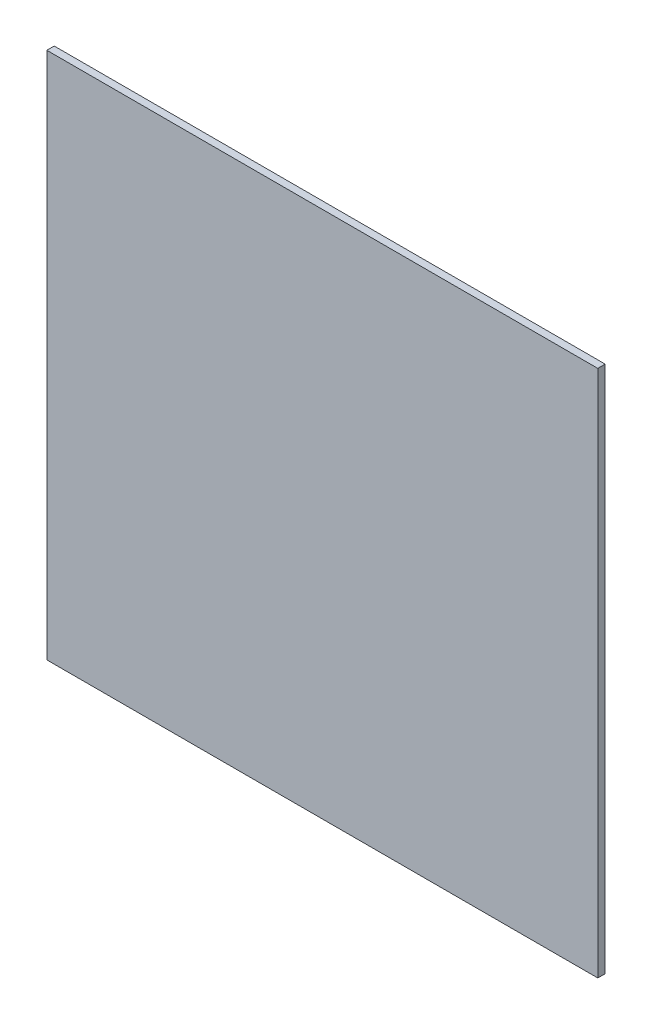
ISO-10303-21;
HEADER;
FILE_DESCRIPTION(('STEP AP214'),'2;1');
FILE_NAME('part.step','',(''),(''),'','','');
FILE_SCHEMA(('AUTOMOTIVE_DESIGN { 1 0 10303 214 1 1 1 1 }'));
ENDSEC;
DATA;
#1=APPLICATION_CONTEXT('core data for automotive mechanical design processes');
#2=APPLICATION_PROTOCOL_DEFINITION('international standard','automotive_design',2000,#1);
#3=PRODUCT_CONTEXT('',#1,'mechanical');
#4=PRODUCT('Part','Part','',(#3));
#5=PRODUCT_RELATED_PRODUCT_CATEGORY('part','',(#4));
#6=PRODUCT_DEFINITION_FORMATION('','',#4);
#7=PRODUCT_DEFINITION_CONTEXT('part definition',#1,'design');
#8=PRODUCT_DEFINITION('design','',#6,#7);
#9=PRODUCT_DEFINITION_SHAPE('','',#8);
#10=(LENGTH_UNIT() NAMED_UNIT(*) SI_UNIT(.MILLI.,.METRE.));
#11=(NAMED_UNIT(*) PLANE_ANGLE_UNIT() SI_UNIT($,.RADIAN.));
#12=(NAMED_UNIT(*) SI_UNIT($,.STERADIAN.) SOLID_ANGLE_UNIT());
#13=UNCERTAINTY_MEASURE_WITH_UNIT(LENGTH_MEASURE(1.E-05),#10,'distance_accuracy_value','');
#14=(GEOMETRIC_REPRESENTATION_CONTEXT(3) GLOBAL_UNCERTAINTY_ASSIGNED_CONTEXT((#13)) GLOBAL_UNIT_ASSIGNED_CONTEXT((#10,
#11,#12)) REPRESENTATION_CONTEXT('',''));
#15=CARTESIAN_POINT('',(0.,0.,0.));
#16=DIRECTION('',(0.,0.,1.));
#17=DIRECTION('',(1.,0.,0.));
#18=AXIS2_PLACEMENT_3D('',#15,#16,#17);
#19=CARTESIAN_POINT('',(161.925,-155.1686,4.3434));
#20=DIRECTION('',(-1.,0.,0.));
#21=DIRECTION('',(0.,0.,1.));
#22=AXIS2_PLACEMENT_3D('',#19,#20,#21);
#23=PLANE('',#22);
#24=DIRECTION('',(0.,1.,0.));
#25=VECTOR('',#24,1.);
#26=CARTESIAN_POINT('',(161.925,-155.1686,0.));
#27=LINE('',#26,#25);
#28=CARTESIAN_POINT('',(161.925,-155.1686,0.));
#29=VERTEX_POINT('',#28);
#30=CARTESIAN_POINT('',(161.925,155.1686,0.));
#31=VERTEX_POINT('',#30);
#32=EDGE_CURVE('E96',#29,#31,#27,.T.);
#33=ORIENTED_EDGE('',*,*,#32,.T.);
#34=DIRECTION('',(0.,0.,-1.));
#35=VECTOR('',#34,1.);
#36=CARTESIAN_POINT('',(161.925,155.1686,4.3434));
#37=LINE('',#36,#35);
#38=CARTESIAN_POINT('',(161.925,155.1686,4.3434));
#39=VERTEX_POINT('',#38);
#40=EDGE_CURVE('E11',#39,#31,#37,.T.);
#41=ORIENTED_EDGE('',*,*,#40,.F.);
#42=DIRECTION('',(0.,1.,0.));
#43=VECTOR('',#42,1.);
#44=CARTESIAN_POINT('',(161.925,-155.1686,4.3434));
#45=LINE('',#44,#43);
#46=CARTESIAN_POINT('',(161.925,-155.1686,4.3434));
#47=VERTEX_POINT('',#46);
#48=EDGE_CURVE('E84',#47,#39,#45,.T.);
#49=ORIENTED_EDGE('',*,*,#48,.F.);
#50=DIRECTION('',(0.,0.,-1.));
#51=VECTOR('',#50,1.);
#52=CARTESIAN_POINT('',(161.925,-155.1686,4.3434));
#53=LINE('',#52,#51);
#54=EDGE_CURVE('E92',#47,#29,#53,.T.);
#55=ORIENTED_EDGE('',*,*,#54,.T.);
#56=EDGE_LOOP('',(#33,#41,#49,#55));
#57=FACE_BOUND('',#56,.T.);
#58=ADVANCED_FACE('F33',(#57),#23,.F.);
#59=CARTESIAN_POINT('',(-161.925,155.1686,4.3434));
#60=DIRECTION('',(0.,-1.,0.));
#61=DIRECTION('',(0.,0.,-1.));
#62=AXIS2_PLACEMENT_3D('',#59,#60,#61);
#63=PLANE('',#62);
#64=DIRECTION('',(-1.,0.,0.));
#65=VECTOR('',#64,1.);
#66=CARTESIAN_POINT('',(-161.925,155.1686,0.));
#67=LINE('',#66,#65);
#68=CARTESIAN_POINT('',(-161.925,155.1686,0.));
#69=VERTEX_POINT('',#68);
#70=EDGE_CURVE('E88',#31,#69,#67,.T.);
#71=ORIENTED_EDGE('',*,*,#70,.T.);
#72=DIRECTION('',(0.,0.,-1.));
#73=VECTOR('',#72,1.);
#74=CARTESIAN_POINT('',(-161.925,155.1686,4.3434));
#75=LINE('',#74,#73);
#76=CARTESIAN_POINT('',(-161.925,155.1686,4.3434));
#77=VERTEX_POINT('',#76);
#78=EDGE_CURVE('E41',#77,#69,#75,.T.);
#79=ORIENTED_EDGE('',*,*,#78,.F.);
#80=DIRECTION('',(-1.,0.,0.));
#81=VECTOR('',#80,1.);
#82=CARTESIAN_POINT('',(-161.925,155.1686,4.3434));
#83=LINE('',#82,#81);
#84=EDGE_CURVE('E79',#39,#77,#83,.T.);
#85=ORIENTED_EDGE('',*,*,#84,.F.);
#86=ORIENTED_EDGE('',*,*,#40,.T.);
#87=EDGE_LOOP('',(#71,#79,#85,#86));
#88=FACE_BOUND('',#87,.T.);
#89=ADVANCED_FACE('F87',(#88),#63,.F.);
#90=CARTESIAN_POINT('',(-161.925,-155.1686,4.3434));
#91=DIRECTION('',(1.,0.,0.));
#92=DIRECTION('',(0.,0.,-1.));
#93=AXIS2_PLACEMENT_3D('',#90,#91,#92);
#94=PLANE('',#93);
#95=DIRECTION('',(0.,-1.,0.));
#96=VECTOR('',#95,1.);
#97=CARTESIAN_POINT('',(-161.925,-155.1686,0.));
#98=LINE('',#97,#96);
#99=CARTESIAN_POINT('',(-161.925,-155.1686,0.));
#100=VERTEX_POINT('',#99);
#101=EDGE_CURVE('E66',#69,#100,#98,.T.);
#102=ORIENTED_EDGE('',*,*,#101,.T.);
#103=DIRECTION('',(0.,0.,-1.));
#104=VECTOR('',#103,1.);
#105=CARTESIAN_POINT('',(-161.925,-155.1686,4.3434));
#106=LINE('',#105,#104);
#107=CARTESIAN_POINT('',(-161.925,-155.1686,4.3434));
#108=VERTEX_POINT('',#107);
#109=EDGE_CURVE('E89',#108,#100,#106,.T.);
#110=ORIENTED_EDGE('',*,*,#109,.F.);
#111=DIRECTION('',(0.,-1.,0.));
#112=VECTOR('',#111,1.);
#113=CARTESIAN_POINT('',(-161.925,-155.1686,4.3434));
#114=LINE('',#113,#112);
#115=EDGE_CURVE('E82',#77,#108,#114,.T.);
#116=ORIENTED_EDGE('',*,*,#115,.F.);
#117=ORIENTED_EDGE('',*,*,#78,.T.);
#118=EDGE_LOOP('',(#102,#110,#116,#117));
#119=FACE_BOUND('',#118,.T.);
#120=ADVANCED_FACE('F90',(#119),#94,.F.);
#121=CARTESIAN_POINT('',(-161.925,-155.1686,4.3434));
#122=DIRECTION('',(0.,1.,0.));
#123=DIRECTION('',(0.,0.,1.));
#124=AXIS2_PLACEMENT_3D('',#121,#122,#123);
#125=PLANE('',#124);
#126=DIRECTION('',(1.,0.,0.));
#127=VECTOR('',#126,1.);
#128=CARTESIAN_POINT('',(-161.925,-155.1686,0.));
#129=LINE('',#128,#127);
#130=EDGE_CURVE('E72',#100,#29,#129,.T.);
#131=ORIENTED_EDGE('',*,*,#130,.T.);
#132=ORIENTED_EDGE('',*,*,#54,.F.);
#133=DIRECTION('',(1.,0.,0.));
#134=VECTOR('',#133,1.);
#135=CARTESIAN_POINT('',(-161.925,-155.1686,4.3434));
#136=LINE('',#135,#134);
#137=EDGE_CURVE('E49',#108,#47,#136,.T.);
#138=ORIENTED_EDGE('',*,*,#137,.F.);
#139=ORIENTED_EDGE('',*,*,#109,.T.);
#140=EDGE_LOOP('',(#131,#132,#138,#139));
#141=FACE_BOUND('',#140,.T.);
#142=ADVANCED_FACE('F103',(#141),#125,.F.);
#143=CARTESIAN_POINT('',(0.,0.,4.3434));
#144=DIRECTION('',(0.,0.,-1.));
#145=DIRECTION('',(-1.,0.,0.));
#146=AXIS2_PLACEMENT_3D('',#143,#144,#145);
#147=PLANE('',#146);
#148=ORIENTED_EDGE('',*,*,#48,.T.);
#149=ORIENTED_EDGE('',*,*,#84,.T.);
#150=ORIENTED_EDGE('',*,*,#115,.T.);
#151=ORIENTED_EDGE('',*,*,#137,.T.);
#152=EDGE_LOOP('',(#148,#149,#150,#151));
#153=FACE_BOUND('',#152,.T.);
#154=ADVANCED_FACE('F80',(#153),#147,.F.);
#155=CARTESIAN_POINT('',(0.,0.,0.));
#156=DIRECTION('',(0.,0.,-1.));
#157=DIRECTION('',(-1.,0.,0.));
#158=AXIS2_PLACEMENT_3D('',#155,#156,#157);
#159=PLANE('',#158);
#160=ORIENTED_EDGE('',*,*,#32,.F.);
#161=ORIENTED_EDGE('',*,*,#130,.F.);
#162=ORIENTED_EDGE('',*,*,#101,.F.);
#163=ORIENTED_EDGE('',*,*,#70,.F.);
#164=EDGE_LOOP('',(#160,#161,#162,#163));
#165=FACE_BOUND('',#164,.T.);
#166=ADVANCED_FACE('F106',(#165),#159,.T.);
#167=CLOSED_SHELL('',(#58,#89,#120,#142,#154,#166));
#168=MANIFOLD_SOLID_BREP('B2',#167);
#169=ADVANCED_BREP_SHAPE_REPRESENTATION('',(#18,#168),#14);
#170=SHAPE_DEFINITION_REPRESENTATION(#9,#169);
ENDSEC;
END-ISO-10303-21;
